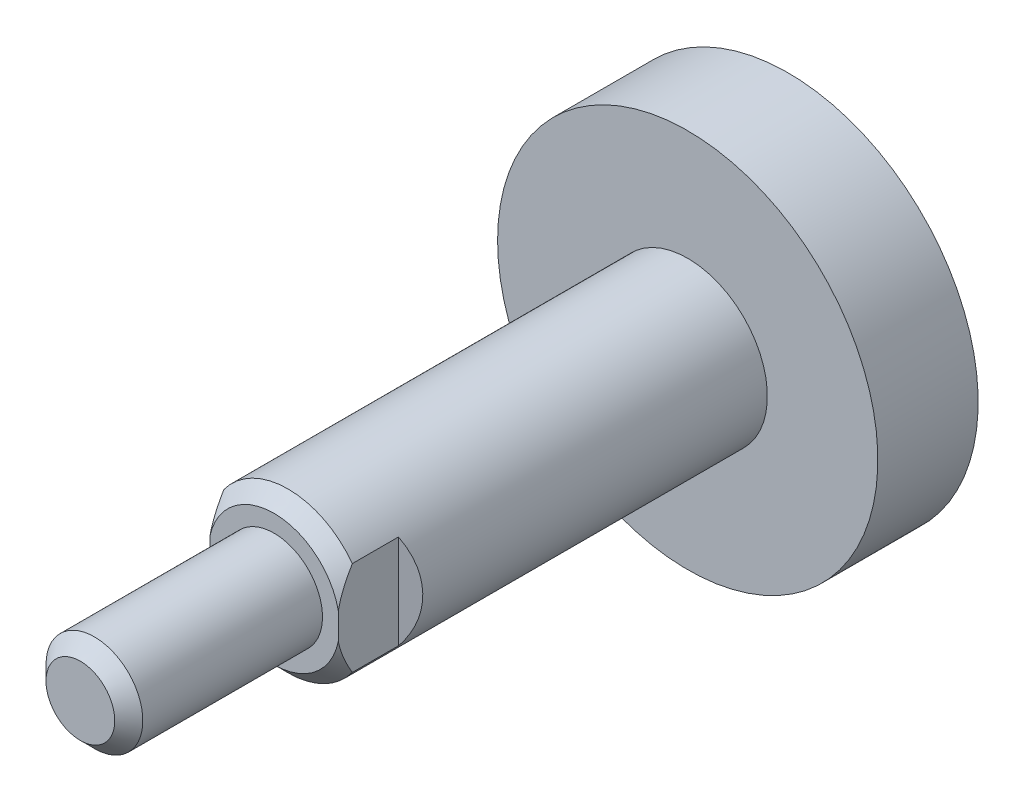
ISO-10303-21;
HEADER;
FILE_DESCRIPTION(('STEP AP214'),'2;1');
FILE_NAME('part.step','',(''),(''),'','','');
FILE_SCHEMA(('AUTOMOTIVE_DESIGN { 1 0 10303 214 1 1 1 1 }'));
ENDSEC;
DATA;
#1=APPLICATION_CONTEXT('core data for automotive mechanical design processes');
#2=APPLICATION_PROTOCOL_DEFINITION('international standard','automotive_design',2000,#1);
#3=PRODUCT_CONTEXT('',#1,'mechanical');
#4=PRODUCT('Part','Part','',(#3));
#5=PRODUCT_RELATED_PRODUCT_CATEGORY('part','',(#4));
#6=PRODUCT_DEFINITION_FORMATION('','',#4);
#7=PRODUCT_DEFINITION_CONTEXT('part definition',#1,'design');
#8=PRODUCT_DEFINITION('design','',#6,#7);
#9=PRODUCT_DEFINITION_SHAPE('','',#8);
#10=(LENGTH_UNIT() NAMED_UNIT(*) SI_UNIT(.MILLI.,.METRE.));
#11=(NAMED_UNIT(*) PLANE_ANGLE_UNIT() SI_UNIT($,.RADIAN.));
#12=(NAMED_UNIT(*) SI_UNIT($,.STERADIAN.) SOLID_ANGLE_UNIT());
#13=UNCERTAINTY_MEASURE_WITH_UNIT(LENGTH_MEASURE(1.E-05),#10,'distance_accuracy_value','');
#14=(GEOMETRIC_REPRESENTATION_CONTEXT(3) GLOBAL_UNCERTAINTY_ASSIGNED_CONTEXT((#13)) GLOBAL_UNIT_ASSIGNED_CONTEXT((#10,
#11,#12)) REPRESENTATION_CONTEXT('',''));
#15=CARTESIAN_POINT('',(0.,0.,0.));
#16=DIRECTION('',(0.,0.,1.));
#17=DIRECTION('',(1.,0.,0.));
#18=AXIS2_PLACEMENT_3D('',#15,#16,#17);
#19=CARTESIAN_POINT('',(0.,0.,35.266));
#20=DIRECTION('',(0.,0.,1.));
#21=DIRECTION('',(1.,0.,0.));
#22=AXIS2_PLACEMENT_3D('',#19,#20,#21);
#23=PLANE('',#22);
#24=CARTESIAN_POINT('',(0.,0.,35.2659999999787));
#25=DIRECTION('',(0.,0.,-1.));
#26=DIRECTION('',(-1.,0.,0.));
#27=AXIS2_PLACEMENT_3D('',#24,#25,#26);
#28=CIRCLE('',#27,1.71299999993835);
#29=CARTESIAN_POINT('',(-1.71299999993835,0.,35.2659999999787));
#30=VERTEX_POINT('',#29);
#31=EDGE_CURVE('E20',#30,#30,#28,.T.);
#32=ORIENTED_EDGE('',*,*,#31,.F.);
#33=EDGE_LOOP('',(#32));
#34=FACE_BOUND('',#33,.T.);
#35=ADVANCED_FACE('F17',(#34),#23,.T.);
#36=CARTESIAN_POINT('',(0.,0.,34.5659999999839));
#37=DIRECTION('',(0.,0.,-1.));
#38=DIRECTION('',(-1.,0.,0.));
#39=AXIS2_PLACEMENT_3D('',#36,#37,#38);
#40=CONICAL_SURFACE('',#39,2.41299999993316,0.785398163397448);
#41=ORIENTED_EDGE('',*,*,#31,.T.);
#42=EDGE_LOOP('',(#41));
#43=FACE_BOUND('',#42,.T.);
#44=CARTESIAN_POINT('',(0.,0.,34.566));
#45=DIRECTION('',(0.,0.,-1.));
#46=DIRECTION('',(-1.,0.,0.));
#47=AXIS2_PLACEMENT_3D('',#44,#45,#46);
#48=CIRCLE('',#47,2.413);
#49=CARTESIAN_POINT('',(-2.413,0.,34.566));
#50=VERTEX_POINT('',#49);
#51=EDGE_CURVE('E72',#50,#50,#48,.T.);
#52=ORIENTED_EDGE('',*,*,#51,.F.);
#53=EDGE_LOOP('',(#52));
#54=FACE_BOUND('',#53,.T.);
#55=ADVANCED_FACE('F201',(#43,#54),#40,.T.);
#56=CARTESIAN_POINT('',(0.,0.,35.266));
#57=DIRECTION('',(0.,0.,-1.));
#58=DIRECTION('',(-1.,0.,0.));
#59=AXIS2_PLACEMENT_3D('',#56,#57,#58);
#60=CYLINDRICAL_SURFACE('',#59,2.413);
#61=ORIENTED_EDGE('',*,*,#51,.T.);
#62=EDGE_LOOP('',(#61));
#63=FACE_BOUND('',#62,.T.);
#64=CARTESIAN_POINT('',(0.,0.,25.614));
#65=DIRECTION('',(0.,0.,-1.));
#66=DIRECTION('',(-1.,0.,0.));
#67=AXIS2_PLACEMENT_3D('',#64,#65,#66);
#68=CIRCLE('',#67,2.413);
#69=CARTESIAN_POINT('',(-2.413,0.,25.614));
#70=VERTEX_POINT('',#69);
#71=EDGE_CURVE('E71',#70,#70,#68,.F.);
#72=ORIENTED_EDGE('',*,*,#71,.T.);
#73=EDGE_LOOP('',(#72));
#74=FACE_BOUND('',#73,.T.);
#75=ADVANCED_FACE('F208',(#63,#74),#60,.T.);
#76=CARTESIAN_POINT('',(0.,0.,25.614));
#77=DIRECTION('',(0.,0.,-1.));
#78=DIRECTION('',(0.,1.,0.));
#79=AXIS2_PLACEMENT_3D('',#76,#77,#78);
#80=PLANE('',#79);
#81=ORIENTED_EDGE('',*,*,#71,.F.);
#82=EDGE_LOOP('',(#81));
#83=FACE_BOUND('',#82,.T.);
#84=DIRECTION('',(0.,1.,0.));
#85=VECTOR('',#84,1.);
#86=CARTESIAN_POINT('',(3.2,0.,25.614));
#87=LINE('',#86,#85);
#88=CARTESIAN_POINT('',(3.2,0.668102537170797,25.6139999999809));
#89=VERTEX_POINT('',#88);
#90=CARTESIAN_POINT('',(3.2,-0.668102537170798,25.6139999999809));
#91=VERTEX_POINT('',#90);
#92=EDGE_CURVE('E59',#89,#91,#87,.F.);
#93=ORIENTED_EDGE('',*,*,#92,.F.);
#94=CARTESIAN_POINT('',(0.,0.,25.6139999999618));
#95=DIRECTION('',(0.,0.,-1.));
#96=DIRECTION('',(0.,1.,0.));
#97=AXIS2_PLACEMENT_3D('',#94,#95,#96);
#98=CIRCLE('',#97,3.26900000004571);
#99=CARTESIAN_POINT('',(-3.2,0.668102537155263,25.6139999999841));
#100=VERTEX_POINT('',#99);
#101=EDGE_CURVE('E92',#100,#89,#98,.T.);
#102=ORIENTED_EDGE('',*,*,#101,.F.);
#103=DIRECTION('',(0.,1.,0.));
#104=VECTOR('',#103,1.);
#105=CARTESIAN_POINT('',(-3.2,-9.475,25.614));
#106=LINE('',#105,#104);
#107=CARTESIAN_POINT('',(-3.2,-0.668102537154732,25.6139999999842));
#108=VERTEX_POINT('',#107);
#109=EDGE_CURVE('E78',#100,#108,#106,.F.);
#110=ORIENTED_EDGE('',*,*,#109,.T.);
#111=CARTESIAN_POINT('',(0.,0.,25.6139999999618));
#112=DIRECTION('',(0.,0.,-1.));
#113=DIRECTION('',(0.,1.,0.));
#114=AXIS2_PLACEMENT_3D('',#111,#112,#113);
#115=CIRCLE('',#114,3.26900000004571);
#116=EDGE_CURVE('E76',#91,#108,#115,.T.);
#117=ORIENTED_EDGE('',*,*,#116,.F.);
#118=EDGE_LOOP('',(#93,#102,#110,#117));
#119=FACE_BOUND('',#118,.T.);
#120=ADVANCED_FACE('F77',(#83,#119),#80,.F.);
#121=CARTESIAN_POINT('',(0.,0.,24.9140000000807));
#122=DIRECTION('',(0.,0.,-1.));
#123=DIRECTION('',(0.,1.,0.));
#124=AXIS2_PLACEMENT_3D('',#121,#122,#123);
#125=CONICAL_SURFACE('',#124,3.96899999998368,0.785398163438051);
#126=CARTESIAN_POINT('',(-3.20000000000324,-0.668102537045559,25.6140000000079));
#127=CARTESIAN_POINT('',(-3.20000000000116,-0.791923989307162,25.5887118948215));
#128=CARTESIAN_POINT('',(-3.20000000000031,-0.914214432197644,25.5569533814339));
#129=CARTESIAN_POINT('',(-3.19999999999969,-1.15522323067472,25.482786734809));
#130=CARTESIAN_POINT('',(-3.19999999999992,-1.27394966585461,25.440405109426));
#131=CARTESIAN_POINT('',(-3.20000000000008,-1.50692397331803,25.3475394481742));
#132=CARTESIAN_POINT('',(-3.20000000000002,-1.62120166838874,25.2971285477279));
#133=CARTESIAN_POINT('',(-3.19999999999998,-1.8466563464418,25.1897204575799));
#134=CARTESIAN_POINT('',(-3.2,-1.95783200288132,25.1327205021669));
#135=CARTESIAN_POINT('',(-3.2,-2.1147772258552,25.047544782855));
#136=CARTESIAN_POINT('',(-3.2,-2.161701362435,25.021462011141));
#137=CARTESIAN_POINT('',(-3.2,-2.25515024754835,24.9683835316909));
#138=CARTESIAN_POINT('',(-3.2,-2.30167405357722,24.9413861634868));
#139=CARTESIAN_POINT('',(-3.2,-2.34796954838271,24.9140000000477));
#140=B_SPLINE_CURVE_WITH_KNOTS('',3,(#126,#127,#128,#129,#130,#131,#132,#133,#134,#135,#136,
#137,#138,#139),.UNSPECIFIED.,.F.,.F.,(4,2,2,2,2,2,4),(0.,0.378663318923574,0.756391005243895,
1.13085654278463,1.50547983437227,1.66653163363144,1.82789340191547),.UNSPECIFIED.);
#141=CARTESIAN_POINT('',(-3.2,-2.3479695483686,24.9140000000238));
#142=VERTEX_POINT('',#141);
#143=EDGE_CURVE('E119',#108,#142,#140,.T.);
#144=ORIENTED_EDGE('',*,*,#143,.T.);
#145=CARTESIAN_POINT('',(0.,0.,24.914));
#146=DIRECTION('',(0.,0.,-1.));
#147=DIRECTION('',(-1.,0.,0.));
#148=AXIS2_PLACEMENT_3D('',#145,#146,#147);
#149=CIRCLE('',#148,3.969);
#150=CARTESIAN_POINT('',(3.2,-2.3479695483686,24.9140000000238));
#151=VERTEX_POINT('',#150);
#152=EDGE_CURVE('E86',#151,#142,#149,.T.);
#153=ORIENTED_EDGE('',*,*,#152,.F.);
#154=CARTESIAN_POINT('',(3.2,-2.34796954838271,24.9140000000477));
#155=CARTESIAN_POINT('',(3.2,-2.28227540638902,24.9528576848915));
#156=CARTESIAN_POINT('',(3.2,-2.21612013329714,24.9909397042438));
#157=CARTESIAN_POINT('',(3.2,-2.08277615458881,25.065293160087));
#158=CARTESIAN_POINT('',(3.2,-2.01558715530726,25.1015640691656));
#159=CARTESIAN_POINT('',(3.2,-1.81330543751406,25.2067462963586));
#160=CARTESIAN_POINT('',(3.2,-1.6765834937986,25.2725768397312));
#161=CARTESIAN_POINT('',(3.2,-1.39788707534561,25.3932563066866));
#162=CARTESIAN_POINT('',(3.2,-1.25590184064602,25.4480810761872));
#163=CARTESIAN_POINT('',(3.2,-0.966123687795267,25.5431571719073));
#164=CARTESIAN_POINT('',(3.2,-0.81829778980787,25.5833066541209));
#165=CARTESIAN_POINT('',(3.2,-0.668102537044839,25.6140000000067));
#166=B_SPLINE_CURVE_WITH_KNOTS('',3,(#154,#155,#156,#157,#158,#159,#160,#161,#162,#163,#164,
#165),.UNSPECIFIED.,.F.,.F.,(4,2,2,2,2,4),(0.,0.228972156487963,0.458010607517393,
0.91289148643811,1.36876002116686,1.82773469580556),.UNSPECIFIED.);
#167=EDGE_CURVE('E64',#151,#91,#166,.T.);
#168=ORIENTED_EDGE('',*,*,#167,.T.);
#169=ORIENTED_EDGE('',*,*,#116,.T.);
#170=EDGE_LOOP('',(#144,#153,#168,#169));
#171=FACE_BOUND('',#170,.T.);
#172=ADVANCED_FACE('F85',(#171),#125,.T.);
#173=CARTESIAN_POINT('',(3.2,-9.475,22.614));
#174=DIRECTION('',(-0.500000000000005,0.,-0.866025403784436));
#175=DIRECTION('',(-0.866025403784436,0.,0.500000000000005));
#176=AXIS2_PLACEMENT_3D('',#173,#174,#175);
#177=PLANE('',#176);
#178=CARTESIAN_POINT('',(0.,0.,24.4615208614068));
#179=DIRECTION('',(-0.500000000000005,0.,-0.866025403784436));
#180=DIRECTION('',(0.866025403784436,0.,-0.500000000000005));
#181=AXIS2_PLACEMENT_3D('',#178,#179,#180);
#182=ELLIPSE('',#181,4.58300643682726,3.969);
#183=CARTESIAN_POINT('',(3.2,2.34796954835449,22.614));
#184=VERTEX_POINT('',#183);
#185=CARTESIAN_POINT('',(3.2,-2.34796954835449,22.614));
#186=VERTEX_POINT('',#185);
#187=EDGE_CURVE('E180',#184,#186,#182,.T.);
#188=ORIENTED_EDGE('',*,*,#187,.F.);
#189=DIRECTION('',(0.,1.,0.));
#190=VECTOR('',#189,1.);
#191=CARTESIAN_POINT('',(3.2,-9.475,22.614));
#192=LINE('',#191,#190);
#193=EDGE_CURVE('E87',#184,#186,#192,.F.);
#194=ORIENTED_EDGE('',*,*,#193,.T.);
#195=EDGE_LOOP('',(#188,#194));
#196=FACE_BOUND('',#195,.T.);
#197=ADVANCED_FACE('F114',(#196),#177,.F.);
#198=CARTESIAN_POINT('',(-3.2,-9.475,22.614));
#199=DIRECTION('',(0.500000000000004,0.,-0.866025403784436));
#200=DIRECTION('',(-0.866025403784436,0.,-0.500000000000004));
#201=AXIS2_PLACEMENT_3D('',#198,#199,#200);
#202=PLANE('',#201);
#203=CARTESIAN_POINT('',(0.,0.,24.4615208614068));
#204=DIRECTION('',(0.500000000000004,0.,-0.866025403784436));
#205=DIRECTION('',(-0.866025403784436,0.,-0.500000000000004));
#206=AXIS2_PLACEMENT_3D('',#203,#204,#205);
#207=ELLIPSE('',#206,4.58300643682726,3.969);
#208=CARTESIAN_POINT('',(-3.2,-2.34796954835449,22.614));
#209=VERTEX_POINT('',#208);
#210=CARTESIAN_POINT('',(-3.2,2.34796954835449,22.614));
#211=VERTEX_POINT('',#210);
#212=EDGE_CURVE('E177',#209,#211,#207,.T.);
#213=ORIENTED_EDGE('',*,*,#212,.F.);
#214=DIRECTION('',(0.,1.,0.));
#215=VECTOR('',#214,1.);
#216=CARTESIAN_POINT('',(-3.2,-9.475,22.614));
#217=LINE('',#216,#215);
#218=EDGE_CURVE('E82',#209,#211,#217,.T.);
#219=ORIENTED_EDGE('',*,*,#218,.T.);
#220=EDGE_LOOP('',(#213,#219));
#221=FACE_BOUND('',#220,.T.);
#222=ADVANCED_FACE('F134',(#221),#202,.F.);
#223=CARTESIAN_POINT('',(-3.2,-9.475,25.614));
#224=DIRECTION('',(1.,0.,0.));
#225=DIRECTION('',(0.,0.,-1.));
#226=AXIS2_PLACEMENT_3D('',#223,#224,#225);
#227=PLANE('',#226);
#228=ORIENTED_EDGE('',*,*,#143,.F.);
#229=ORIENTED_EDGE('',*,*,#109,.F.);
#230=CARTESIAN_POINT('',(-3.19999999998987,2.34796954838807,24.9140000000384));
#231=CARTESIAN_POINT('',(-3.19999999999627,2.28227540639574,24.9528576848853));
#232=CARTESIAN_POINT('',(-3.19999999999898,2.21612013330425,24.9909397042391));
#233=CARTESIAN_POINT('',(-3.20000000000102,2.08277615459583,25.0652931600838));
#234=CARTESIAN_POINT('',(-3.20000000000036,2.01558715531381,25.1015640691624));
#235=CARTESIAN_POINT('',(-3.19999999999929,1.81330543751945,25.2067462963555));
#236=CARTESIAN_POINT('',(-3.1999999999998,1.67658349380355,25.2725768397288));
#237=CARTESIAN_POINT('',(-3.2000000000002,1.39788707534955,25.3932563066852));
#238=CARTESIAN_POINT('',(-3.2000000000001,1.2559018406494,25.4480810761861));
#239=CARTESIAN_POINT('',(-3.1999999999999,0.966123687797418,25.5431571719066));
#240=CARTESIAN_POINT('',(-3.19999999999979,0.818297789809342,25.5833066541205));
#241=CARTESIAN_POINT('',(-3.2,0.668102537045687,25.6140000000065));
#242=B_SPLINE_CURVE_WITH_KNOTS('',3,(#230,#231,#232,#233,#234,#235,#236,#237,#238,#239,#240,
#241),.UNSPECIFIED.,.F.,.F.,(4,2,2,2,2,4),(0.,0.228972156489184,0.458010607519769,
0.912891486442607,1.3687600211732,1.82773469581398),.UNSPECIFIED.);
#243=CARTESIAN_POINT('',(-3.2,2.34796954835449,24.9140000000322));
#244=VERTEX_POINT('',#243);
#245=EDGE_CURVE('E125',#244,#100,#242,.T.);
#246=ORIENTED_EDGE('',*,*,#245,.F.);
#247=DIRECTION('',(0.,0.,-1.));
#248=VECTOR('',#247,1.);
#249=CARTESIAN_POINT('',(-3.2,2.34796954835449,36.8400272581176));
#250=LINE('',#249,#248);
#251=EDGE_CURVE('E179',#211,#244,#250,.F.);
#252=ORIENTED_EDGE('',*,*,#251,.F.);
#253=ORIENTED_EDGE('',*,*,#218,.F.);
#254=DIRECTION('',(0.,0.,-1.));
#255=VECTOR('',#254,1.);
#256=CARTESIAN_POINT('',(-3.2,-2.34796954835449,36.8400272581176));
#257=LINE('',#256,#255);
#258=EDGE_CURVE('E182',#142,#209,#257,.T.);
#259=ORIENTED_EDGE('',*,*,#258,.F.);
#260=EDGE_LOOP('',(#228,#229,#246,#252,#253,#259));
#261=FACE_BOUND('',#260,.T.);
#262=ADVANCED_FACE('F130',(#261),#227,.F.);
#263=CARTESIAN_POINT('',(0.,0.,24.9140000000807));
#264=DIRECTION('',(0.,0.,-1.));
#265=DIRECTION('',(0.,1.,0.));
#266=AXIS2_PLACEMENT_3D('',#263,#264,#265);
#267=CONICAL_SURFACE('',#266,3.96899999998368,0.785398163438051);
#268=ORIENTED_EDGE('',*,*,#245,.T.);
#269=ORIENTED_EDGE('',*,*,#101,.T.);
#270=CARTESIAN_POINT('',(3.20000000000325,0.668102537045564,25.6140000000079));
#271=CARTESIAN_POINT('',(3.20000000000117,0.791923989307168,25.5887118948215));
#272=CARTESIAN_POINT('',(3.20000000000031,0.914214432197651,25.5569533814339));
#273=CARTESIAN_POINT('',(3.19999999999969,1.15522323067473,25.482786734809));
#274=CARTESIAN_POINT('',(3.19999999999992,1.27394966585462,25.440405109426));
#275=CARTESIAN_POINT('',(3.20000000000008,1.50692397331804,25.3475394481742));
#276=CARTESIAN_POINT('',(3.20000000000003,1.62120166838875,25.2971285477279));
#277=CARTESIAN_POINT('',(3.19999999999998,1.84665634644181,25.1897204575799));
#278=CARTESIAN_POINT('',(3.2,1.95783200288133,25.1327205021669));
#279=CARTESIAN_POINT('',(3.20000000000001,2.11477722585521,25.0475447828549));
#280=CARTESIAN_POINT('',(3.2,2.161701362435,25.021462011141));
#281=CARTESIAN_POINT('',(3.2,2.25515024754835,24.9683835316909));
#282=CARTESIAN_POINT('',(3.2,2.30167405357722,24.9413861634868));
#283=CARTESIAN_POINT('',(3.2,2.34796954838271,24.9140000000477));
#284=B_SPLINE_CURVE_WITH_KNOTS('',3,(#270,#271,#272,#273,#274,#275,#276,#277,#278,#279,#280,
#281,#282,#283),.UNSPECIFIED.,.F.,.F.,(4,2,2,2,2,2,4),(0.,0.378663318923575,0.756391005243901,
1.13085654278463,1.50547983437227,1.66653163363144,1.82789340191546),.UNSPECIFIED.);
#285=CARTESIAN_POINT('',(3.2,2.3479695483686,24.9140000000238));
#286=VERTEX_POINT('',#285);
#287=EDGE_CURVE('E67',#89,#286,#284,.T.);
#288=ORIENTED_EDGE('',*,*,#287,.T.);
#289=CARTESIAN_POINT('',(0.,0.,24.914));
#290=DIRECTION('',(0.,0.,-1.));
#291=DIRECTION('',(-1.,0.,0.));
#292=AXIS2_PLACEMENT_3D('',#289,#290,#291);
#293=CIRCLE('',#292,3.969);
#294=EDGE_CURVE('E35',#244,#286,#293,.T.);
#295=ORIENTED_EDGE('',*,*,#294,.F.);
#296=EDGE_LOOP('',(#268,#269,#288,#295));
#297=FACE_BOUND('',#296,.T.);
#298=ADVANCED_FACE('F133',(#297),#267,.T.);
#299=CARTESIAN_POINT('',(3.2,-9.475,25.614));
#300=DIRECTION('',(-1.,0.,0.));
#301=DIRECTION('',(0.,0.,1.));
#302=AXIS2_PLACEMENT_3D('',#299,#300,#301);
#303=PLANE('',#302);
#304=ORIENTED_EDGE('',*,*,#287,.F.);
#305=ORIENTED_EDGE('',*,*,#92,.T.);
#306=ORIENTED_EDGE('',*,*,#167,.F.);
#307=DIRECTION('',(0.,0.,-1.));
#308=VECTOR('',#307,1.);
#309=CARTESIAN_POINT('',(3.20000000000001,-2.34796954835449,36.8400272581176));
#310=LINE('',#309,#308);
#311=EDGE_CURVE('E89',#186,#151,#310,.F.);
#312=ORIENTED_EDGE('',*,*,#311,.F.);
#313=ORIENTED_EDGE('',*,*,#193,.F.);
#314=DIRECTION('',(0.,0.,-1.));
#315=VECTOR('',#314,1.);
#316=CARTESIAN_POINT('',(3.2,2.34796954835449,36.8400272581176));
#317=LINE('',#316,#315);
#318=EDGE_CURVE('E171',#286,#184,#317,.T.);
#319=ORIENTED_EDGE('',*,*,#318,.F.);
#320=EDGE_LOOP('',(#304,#305,#306,#312,#313,#319));
#321=FACE_BOUND('',#320,.T.);
#322=ADVANCED_FACE('F61',(#321),#303,.F.);
#323=CARTESIAN_POINT('',(0.,0.,36.8400272581176));
#324=DIRECTION('',(0.,0.,-1.));
#325=DIRECTION('',(-1.,0.,0.));
#326=AXIS2_PLACEMENT_3D('',#323,#324,#325);
#327=CYLINDRICAL_SURFACE('',#326,3.969);
#328=CARTESIAN_POINT('',(0.,0.,5.));
#329=DIRECTION('',(0.,0.,-1.));
#330=DIRECTION('',(-1.,0.,0.));
#331=AXIS2_PLACEMENT_3D('',#328,#329,#330);
#332=CIRCLE('',#331,3.969);
#333=CARTESIAN_POINT('',(-3.969,0.,5.));
#334=VERTEX_POINT('',#333);
#335=EDGE_CURVE('E169',#334,#334,#332,.T.);
#336=ORIENTED_EDGE('',*,*,#335,.F.);
#337=EDGE_LOOP('',(#336));
#338=FACE_BOUND('',#337,.T.);
#339=ORIENTED_EDGE('',*,*,#294,.T.);
#340=ORIENTED_EDGE('',*,*,#318,.T.);
#341=ORIENTED_EDGE('',*,*,#187,.T.);
#342=ORIENTED_EDGE('',*,*,#311,.T.);
#343=ORIENTED_EDGE('',*,*,#152,.T.);
#344=ORIENTED_EDGE('',*,*,#258,.T.);
#345=ORIENTED_EDGE('',*,*,#212,.T.);
#346=ORIENTED_EDGE('',*,*,#251,.T.);
#347=EDGE_LOOP('',(#339,#340,#341,#342,#343,#344,#345,#346));
#348=FACE_BOUND('',#347,.T.);
#349=ADVANCED_FACE('F160',(#338,#348),#327,.T.);
#350=CARTESIAN_POINT('',(0.,0.,5.));
#351=DIRECTION('',(0.,0.,1.));
#352=DIRECTION('',(1.,0.,0.));
#353=AXIS2_PLACEMENT_3D('',#350,#351,#352);
#354=PLANE('',#353);
#355=CARTESIAN_POINT('',(0.,0.,5.));
#356=DIRECTION('',(0.,0.,-1.));
#357=DIRECTION('',(-1.,0.,0.));
#358=AXIS2_PLACEMENT_3D('',#355,#356,#357);
#359=CIRCLE('',#358,9.475);
#360=CARTESIAN_POINT('',(-9.475,0.,5.));
#361=VERTEX_POINT('',#360);
#362=EDGE_CURVE('E26',#361,#361,#359,.T.);
#363=ORIENTED_EDGE('',*,*,#362,.F.);
#364=EDGE_LOOP('',(#363));
#365=FACE_BOUND('',#364,.T.);
#366=ORIENTED_EDGE('',*,*,#335,.T.);
#367=EDGE_LOOP('',(#366));
#368=FACE_BOUND('',#367,.T.);
#369=ADVANCED_FACE('F154',(#365,#368),#354,.T.);
#370=CARTESIAN_POINT('',(0.,0.,5.));
#371=DIRECTION('',(0.,0.,-1.));
#372=DIRECTION('',(-1.,0.,0.));
#373=AXIS2_PLACEMENT_3D('',#370,#371,#372);
#374=CYLINDRICAL_SURFACE('',#373,9.475);
#375=ORIENTED_EDGE('',*,*,#362,.T.);
#376=EDGE_LOOP('',(#375));
#377=FACE_BOUND('',#376,.T.);
#378=CARTESIAN_POINT('',(0.,0.,0.));
#379=DIRECTION('',(0.,0.,-1.));
#380=DIRECTION('',(-1.,0.,0.));
#381=AXIS2_PLACEMENT_3D('',#378,#379,#380);
#382=CIRCLE('',#381,9.475);
#383=CARTESIAN_POINT('',(-9.475,0.,0.));
#384=VERTEX_POINT('',#383);
#385=EDGE_CURVE('E11',#384,#384,#382,.F.);
#386=ORIENTED_EDGE('',*,*,#385,.T.);
#387=EDGE_LOOP('',(#386));
#388=FACE_BOUND('',#387,.T.);
#389=ADVANCED_FACE('F148',(#377,#388),#374,.T.);
#390=CARTESIAN_POINT('',(0.,0.,0.));
#391=DIRECTION('',(0.,0.,1.));
#392=DIRECTION('',(1.,0.,0.));
#393=AXIS2_PLACEMENT_3D('',#390,#391,#392);
#394=PLANE('',#393);
#395=ORIENTED_EDGE('',*,*,#385,.F.);
#396=EDGE_LOOP('',(#395));
#397=FACE_BOUND('',#396,.T.);
#398=ADVANCED_FACE('F146',(#397),#394,.F.);
#399=CLOSED_SHELL('',(#35,#55,#75,#120,#172,#197,#222,#262,#298,#322,#349,#369,#389,#398));
#400=MANIFOLD_SOLID_BREP('B1',#399);
#401=ADVANCED_BREP_SHAPE_REPRESENTATION('',(#18,#400),#14);
#402=SHAPE_DEFINITION_REPRESENTATION(#9,#401);
ENDSEC;
END-ISO-10303-21;
